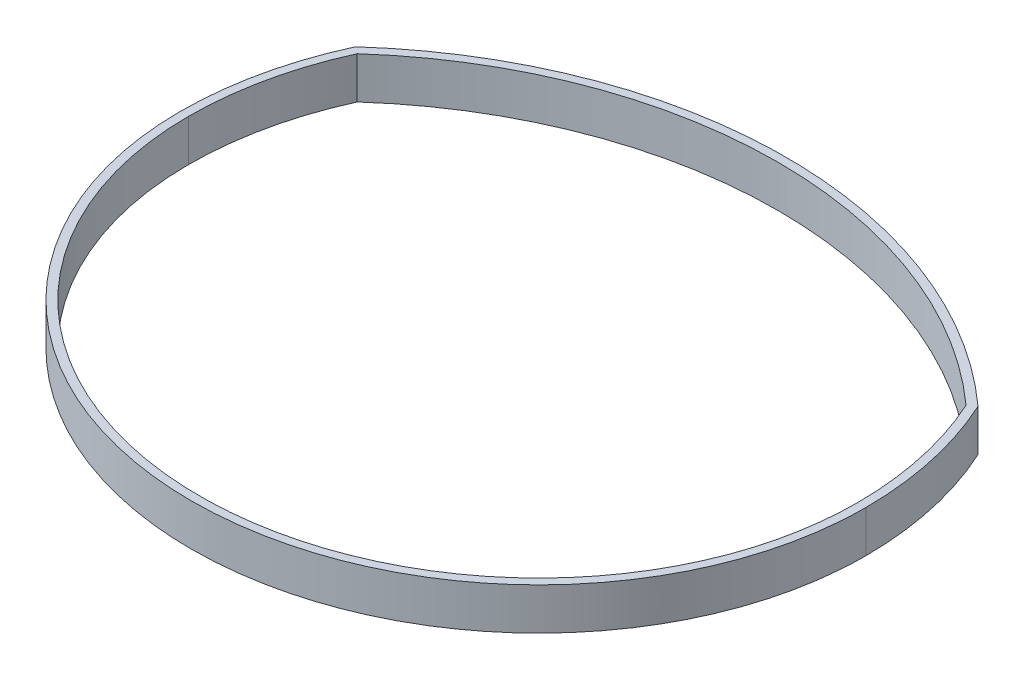
ISO-10303-21;
HEADER;
FILE_DESCRIPTION(('STEP AP214'),'2;1');
FILE_NAME('part.step','',(''),(''),'','','');
FILE_SCHEMA(('AUTOMOTIVE_DESIGN { 1 0 10303 214 1 1 1 1 }'));
ENDSEC;
DATA;
#1=APPLICATION_CONTEXT('core data for automotive mechanical design processes');
#2=APPLICATION_PROTOCOL_DEFINITION('international standard','automotive_design',2000,#1);
#3=PRODUCT_CONTEXT('',#1,'mechanical');
#4=PRODUCT('Part','Part','',(#3));
#5=PRODUCT_RELATED_PRODUCT_CATEGORY('part','',(#4));
#6=PRODUCT_DEFINITION_FORMATION('','',#4);
#7=PRODUCT_DEFINITION_CONTEXT('part definition',#1,'design');
#8=PRODUCT_DEFINITION('design','',#6,#7);
#9=PRODUCT_DEFINITION_SHAPE('','',#8);
#10=(LENGTH_UNIT() NAMED_UNIT(*) SI_UNIT(.MILLI.,.METRE.));
#11=(NAMED_UNIT(*) PLANE_ANGLE_UNIT() SI_UNIT($,.RADIAN.));
#12=(NAMED_UNIT(*) SI_UNIT($,.STERADIAN.) SOLID_ANGLE_UNIT());
#13=UNCERTAINTY_MEASURE_WITH_UNIT(LENGTH_MEASURE(1.E-05),#10,'distance_accuracy_value','');
#14=(GEOMETRIC_REPRESENTATION_CONTEXT(3) GLOBAL_UNCERTAINTY_ASSIGNED_CONTEXT((#13)) GLOBAL_UNIT_ASSIGNED_CONTEXT((#10,
#11,#12)) REPRESENTATION_CONTEXT('',''));
#15=CARTESIAN_POINT('',(0.,0.,0.));
#16=DIRECTION('',(0.,0.,1.));
#17=DIRECTION('',(1.,0.,0.));
#18=AXIS2_PLACEMENT_3D('',#15,#16,#17);
#19=CARTESIAN_POINT('',(0.,12.7,0.));
#20=DIRECTION('',(0.,-1.,0.));
#21=DIRECTION('',(0.,0.,-1.));
#22=AXIS2_PLACEMENT_3D('',#19,#20,#21);
#23=CYLINDRICAL_SURFACE('',#22,104.14);
#24=CARTESIAN_POINT('',(0.,0.,0.));
#25=DIRECTION('',(0.,1.,0.));
#26=DIRECTION('',(0.,0.,1.));
#27=AXIS2_PLACEMENT_3D('',#24,#25,#26);
#28=CIRCLE('',#27,104.14);
#29=CARTESIAN_POINT('',(-94.5401465283261,0.,-43.6726492716279));
#30=VERTEX_POINT('',#29);
#31=CARTESIAN_POINT('',(-104.14,0.,0.));
#32=VERTEX_POINT('',#31);
#33=EDGE_CURVE('E160',#30,#32,#28,.T.);
#34=ORIENTED_EDGE('',*,*,#33,.T.);
#35=DIRECTION('',(0.,-1.,0.));
#36=VECTOR('',#35,1.);
#37=CARTESIAN_POINT('',(-104.14,12.7,0.));
#38=LINE('',#37,#36);
#39=CARTESIAN_POINT('',(-104.14,12.7,0.));
#40=VERTEX_POINT('',#39);
#41=EDGE_CURVE('E11',#40,#32,#38,.T.);
#42=ORIENTED_EDGE('',*,*,#41,.F.);
#43=CARTESIAN_POINT('',(0.,12.7,0.));
#44=DIRECTION('',(0.,1.,0.));
#45=DIRECTION('',(0.,0.,1.));
#46=AXIS2_PLACEMENT_3D('',#43,#44,#45);
#47=CIRCLE('',#46,104.14);
#48=CARTESIAN_POINT('',(-94.5401465283261,12.7,-43.6726492716279));
#49=VERTEX_POINT('',#48);
#50=EDGE_CURVE('E123',#49,#40,#47,.T.);
#51=ORIENTED_EDGE('',*,*,#50,.F.);
#52=DIRECTION('',(0.,-1.,0.));
#53=VECTOR('',#52,1.);
#54=CARTESIAN_POINT('',(-94.5401465283261,12.7,-43.6726492716279));
#55=LINE('',#54,#53);
#56=EDGE_CURVE('E176',#49,#30,#55,.T.);
#57=ORIENTED_EDGE('',*,*,#56,.T.);
#58=EDGE_LOOP('',(#34,#42,#51,#57));
#59=FACE_BOUND('',#58,.T.);
#60=ADVANCED_FACE('F41',(#59),#23,.T.);
#61=CARTESIAN_POINT('',(-104.14,12.7,0.));
#62=CARTESIAN_POINT('',(-104.14,12.7,6.58621642734078));
#63=CARTESIAN_POINT('',(-102.793867123713,12.7,19.7873509878516));
#64=CARTESIAN_POINT('',(-94.8352631791728,12.7,45.1445437391471));
#65=CARTESIAN_POINT('',(-75.5215052836676,12.7,73.0746110420761));
#66=CARTESIAN_POINT('',(-40.8557906224662,12.7,95.438590327051));
#67=CARTESIAN_POINT('',(0.,12.7,103.286907831159));
#68=CARTESIAN_POINT('',(40.8557906224662,12.7,95.438590327051));
#69=CARTESIAN_POINT('',(75.5215052836676,12.7,73.0746110420761));
#70=CARTESIAN_POINT('',(94.8352631791728,12.7,45.1445437391471));
#71=CARTESIAN_POINT('',(102.793867123713,12.7,19.7873509878516));
#72=CARTESIAN_POINT('',(104.14,12.7,6.58621642734078));
#73=CARTESIAN_POINT('',(104.14,12.7,0.));
#74=B_SPLINE_CURVE_WITH_KNOTS('',3,(#61,#62,#63,#64,#65,#66,#67,#68,#69,#70,#71,#72,#73),
.UNSPECIFIED.,.F.,.F.,(4,1,1,1,1,1,1,1,1,1,4),(0.,0.196349540849362,0.392699081698724,
0.785398163397448,1.17809724509617,1.5707963267949,1.96349540849362,2.35619449019234,
2.74889357189107,2.94524311274043,3.14159265358979),.UNSPECIFIED.);
#75=DIRECTION('',(0.,-1.,0.));
#76=VECTOR('',#75,1.);
#77=SURFACE_OF_LINEAR_EXTRUSION('',#74,#76);
#78=CARTESIAN_POINT('',(-104.14,0.,0.));
#79=CARTESIAN_POINT('',(-104.14,0.,6.58621642734078));
#80=CARTESIAN_POINT('',(-102.793867123713,0.,19.7873509878516));
#81=CARTESIAN_POINT('',(-94.8352631791728,0.,45.1445437391471));
#82=CARTESIAN_POINT('',(-75.5215052836676,0.,73.0746110420761));
#83=CARTESIAN_POINT('',(-40.8557906224662,0.,95.438590327051));
#84=CARTESIAN_POINT('',(0.,0.,103.286907831159));
#85=CARTESIAN_POINT('',(40.8557906224662,0.,95.438590327051));
#86=CARTESIAN_POINT('',(75.5215052836676,0.,73.0746110420761));
#87=CARTESIAN_POINT('',(94.8352631791728,0.,45.1445437391471));
#88=CARTESIAN_POINT('',(102.793867123713,0.,19.7873509878516));
#89=CARTESIAN_POINT('',(104.14,0.,6.58621642734078));
#90=CARTESIAN_POINT('',(104.14,0.,0.));
#91=B_SPLINE_CURVE_WITH_KNOTS('',3,(#78,#79,#80,#81,#82,#83,#84,#85,#86,#87,#88,#89,#90),
.UNSPECIFIED.,.F.,.F.,(4,1,1,1,1,1,1,1,1,1,4),(0.,0.196349540849362,0.392699081698724,
0.785398163397448,1.17809724509617,1.5707963267949,1.96349540849362,2.35619449019234,
2.74889357189107,2.94524311274043,3.14159265358979),.UNSPECIFIED.);
#92=CARTESIAN_POINT('',(104.14,0.,0.));
#93=VERTEX_POINT('',#92);
#94=EDGE_CURVE('E129',#32,#93,#91,.T.);
#95=ORIENTED_EDGE('',*,*,#94,.T.);
#96=DIRECTION('',(0.,-1.,0.));
#97=VECTOR('',#96,1.);
#98=CARTESIAN_POINT('',(104.14,12.7,0.));
#99=LINE('',#98,#97);
#100=CARTESIAN_POINT('',(104.14,12.7,0.));
#101=VERTEX_POINT('',#100);
#102=EDGE_CURVE('E52',#101,#93,#99,.T.);
#103=ORIENTED_EDGE('',*,*,#102,.F.);
#104=EDGE_CURVE('E117',#40,#101,#74,.T.);
#105=ORIENTED_EDGE('',*,*,#104,.F.);
#106=ORIENTED_EDGE('',*,*,#41,.T.);
#107=EDGE_LOOP('',(#95,#103,#105,#106));
#108=FACE_BOUND('',#107,.T.);
#109=ADVANCED_FACE('F128',(#108),#77,.F.);
#110=CARTESIAN_POINT('',(0.,12.7,0.));
#111=DIRECTION('',(0.,-1.,0.));
#112=DIRECTION('',(0.,0.,-1.));
#113=AXIS2_PLACEMENT_3D('',#110,#111,#112);
#114=CYLINDRICAL_SURFACE('',#113,104.14);
#115=CARTESIAN_POINT('',(0.,0.,0.));
#116=DIRECTION('',(0.,1.,0.));
#117=DIRECTION('',(0.,0.,1.));
#118=AXIS2_PLACEMENT_3D('',#115,#116,#117);
#119=CIRCLE('',#118,104.14);
#120=CARTESIAN_POINT('',(94.5401465283261,0.,-43.672649271628));
#121=VERTEX_POINT('',#120);
#122=EDGE_CURVE('E90',#93,#121,#119,.T.);
#123=ORIENTED_EDGE('',*,*,#122,.T.);
#124=DIRECTION('',(0.,-1.,0.));
#125=VECTOR('',#124,1.);
#126=CARTESIAN_POINT('',(94.5401465283261,12.7,-43.672649271628));
#127=LINE('',#126,#125);
#128=CARTESIAN_POINT('',(94.5401465283261,12.7,-43.672649271628));
#129=VERTEX_POINT('',#128);
#130=EDGE_CURVE('E131',#129,#121,#127,.T.);
#131=ORIENTED_EDGE('',*,*,#130,.F.);
#132=CARTESIAN_POINT('',(0.,12.7,0.));
#133=DIRECTION('',(0.,1.,0.));
#134=DIRECTION('',(0.,0.,1.));
#135=AXIS2_PLACEMENT_3D('',#132,#133,#134);
#136=CIRCLE('',#135,104.14);
#137=EDGE_CURVE('E121',#101,#129,#136,.T.);
#138=ORIENTED_EDGE('',*,*,#137,.F.);
#139=ORIENTED_EDGE('',*,*,#102,.T.);
#140=EDGE_LOOP('',(#123,#131,#138,#139));
#141=FACE_BOUND('',#140,.T.);
#142=ADVANCED_FACE('F133',(#141),#114,.T.);
#143=CARTESIAN_POINT('',(0.,12.7,0.));
#144=DIRECTION('',(0.,-1.,0.));
#145=DIRECTION('',(0.,0.,-1.));
#146=AXIS2_PLACEMENT_3D('',#143,#144,#145);
#147=CYLINDRICAL_SURFACE('',#146,101.6);
#148=CARTESIAN_POINT('',(0.,0.,0.));
#149=DIRECTION('',(0.,1.,0.));
#150=DIRECTION('',(0.,0.,1.));
#151=AXIS2_PLACEMENT_3D('',#148,#149,#150);
#152=CIRCLE('',#151,101.6);
#153=CARTESIAN_POINT('',(-92.4508074401865,0.,-42.1355930735234));
#154=VERTEX_POINT('',#153);
#155=CARTESIAN_POINT('',(-101.6,0.,0.));
#156=VERTEX_POINT('',#155);
#157=EDGE_CURVE('E144',#154,#156,#152,.T.);
#158=ORIENTED_EDGE('',*,*,#157,.F.);
#159=DIRECTION('',(0.,-1.,0.));
#160=VECTOR('',#159,1.);
#161=CARTESIAN_POINT('',(-92.4508074401865,12.7,-42.1355930735234));
#162=LINE('',#161,#160);
#163=CARTESIAN_POINT('',(-92.4508074401865,12.7,-42.1355930735234));
#164=VERTEX_POINT('',#163);
#165=EDGE_CURVE('E45',#164,#154,#162,.T.);
#166=ORIENTED_EDGE('',*,*,#165,.F.);
#167=CARTESIAN_POINT('',(0.,12.7,0.));
#168=DIRECTION('',(0.,1.,0.));
#169=DIRECTION('',(0.,0.,1.));
#170=AXIS2_PLACEMENT_3D('',#167,#168,#169);
#171=CIRCLE('',#170,101.6);
#172=CARTESIAN_POINT('',(-101.6,12.7,0.));
#173=VERTEX_POINT('',#172);
#174=EDGE_CURVE('E175',#164,#173,#171,.T.);
#175=ORIENTED_EDGE('',*,*,#174,.T.);
#176=DIRECTION('',(0.,-1.,0.));
#177=VECTOR('',#176,1.);
#178=CARTESIAN_POINT('',(-101.6,12.7,0.));
#179=LINE('',#178,#177);
#180=EDGE_CURVE('E137',#173,#156,#179,.T.);
#181=ORIENTED_EDGE('',*,*,#180,.T.);
#182=EDGE_LOOP('',(#158,#166,#175,#181));
#183=FACE_BOUND('',#182,.T.);
#184=ADVANCED_FACE('F43',(#183),#147,.F.);
#185=CARTESIAN_POINT('',(0.,12.7,61.0492054603025));
#186=DIRECTION('',(0.,-1.,0.));
#187=DIRECTION('',(0.,0.,-1.));
#188=AXIS2_PLACEMENT_3D('',#185,#186,#187);
#189=CYLINDRICAL_SURFACE('',#188,138.543330567764);
#190=CARTESIAN_POINT('',(0.,0.,61.0492054603025));
#191=DIRECTION('',(0.,1.,0.));
#192=DIRECTION('',(0.,0.,1.));
#193=AXIS2_PLACEMENT_3D('',#190,#191,#192);
#194=CIRCLE('',#193,138.543330567764);
#195=CARTESIAN_POINT('',(92.4508074401865,0.,-42.1355930735234));
#196=VERTEX_POINT('',#195);
#197=EDGE_CURVE('E148',#196,#154,#194,.T.);
#198=ORIENTED_EDGE('',*,*,#197,.F.);
#199=DIRECTION('',(0.,-1.,0.));
#200=VECTOR('',#199,1.);
#201=CARTESIAN_POINT('',(92.4508074401865,12.7,-42.1355930735234));
#202=LINE('',#201,#200);
#203=CARTESIAN_POINT('',(92.4508074401865,12.7,-42.1355930735234));
#204=VERTEX_POINT('',#203);
#205=EDGE_CURVE('E185',#204,#196,#202,.T.);
#206=ORIENTED_EDGE('',*,*,#205,.F.);
#207=CARTESIAN_POINT('',(0.,12.7,61.0492054603025));
#208=DIRECTION('',(0.,1.,0.));
#209=DIRECTION('',(0.,0.,1.));
#210=AXIS2_PLACEMENT_3D('',#207,#208,#209);
#211=CIRCLE('',#210,138.543330567764);
#212=EDGE_CURVE('E196',#204,#164,#211,.T.);
#213=ORIENTED_EDGE('',*,*,#212,.T.);
#214=ORIENTED_EDGE('',*,*,#165,.T.);
#215=EDGE_LOOP('',(#198,#206,#213,#214));
#216=FACE_BOUND('',#215,.T.);
#217=ADVANCED_FACE('F194',(#216),#189,.F.);
#218=CARTESIAN_POINT('',(0.,12.7,0.));
#219=DIRECTION('',(0.,-1.,0.));
#220=DIRECTION('',(0.,0.,-1.));
#221=AXIS2_PLACEMENT_3D('',#218,#219,#220);
#222=CYLINDRICAL_SURFACE('',#221,101.6);
#223=CARTESIAN_POINT('',(0.,0.,0.));
#224=DIRECTION('',(0.,1.,0.));
#225=DIRECTION('',(0.,0.,1.));
#226=AXIS2_PLACEMENT_3D('',#223,#224,#225);
#227=CIRCLE('',#226,101.6);
#228=CARTESIAN_POINT('',(101.6,0.,0.));
#229=VERTEX_POINT('',#228);
#230=EDGE_CURVE('E152',#229,#196,#227,.T.);
#231=ORIENTED_EDGE('',*,*,#230,.F.);
#232=DIRECTION('',(0.,-1.,0.));
#233=VECTOR('',#232,1.);
#234=CARTESIAN_POINT('',(101.6,12.7,0.));
#235=LINE('',#234,#233);
#236=CARTESIAN_POINT('',(101.6,12.7,0.));
#237=VERTEX_POINT('',#236);
#238=EDGE_CURVE('E183',#237,#229,#235,.T.);
#239=ORIENTED_EDGE('',*,*,#238,.F.);
#240=CARTESIAN_POINT('',(0.,12.7,0.));
#241=DIRECTION('',(0.,1.,0.));
#242=DIRECTION('',(0.,0.,1.));
#243=AXIS2_PLACEMENT_3D('',#240,#241,#242);
#244=CIRCLE('',#243,101.6);
#245=EDGE_CURVE('E203',#237,#204,#244,.T.);
#246=ORIENTED_EDGE('',*,*,#245,.T.);
#247=ORIENTED_EDGE('',*,*,#205,.T.);
#248=EDGE_LOOP('',(#231,#239,#246,#247));
#249=FACE_BOUND('',#248,.T.);
#250=ADVANCED_FACE('F201',(#249),#222,.F.);
#251=CARTESIAN_POINT('',(0.,12.7,0.));
#252=DIRECTION('',(0.,1.,0.));
#253=DIRECTION('',(-1.,0.,0.));
#254=AXIS2_PLACEMENT_3D('',#251,#252,#253);
#255=ELLIPSE('',#254,101.6,98.1308019964563);
#256=DIRECTION('',(0.,-1.,0.));
#257=VECTOR('',#256,1.);
#258=SURFACE_OF_LINEAR_EXTRUSION('',#255,#257);
#259=CARTESIAN_POINT('',(0.,0.,0.));
#260=DIRECTION('',(0.,1.,0.));
#261=DIRECTION('',(-1.,0.,0.));
#262=AXIS2_PLACEMENT_3D('',#259,#260,#261);
#263=ELLIPSE('',#262,101.6,98.1308019964563);
#264=EDGE_CURVE('E156',#156,#229,#263,.T.);
#265=ORIENTED_EDGE('',*,*,#264,.F.);
#266=ORIENTED_EDGE('',*,*,#180,.F.);
#267=EDGE_CURVE('E208',#173,#237,#255,.T.);
#268=ORIENTED_EDGE('',*,*,#267,.T.);
#269=ORIENTED_EDGE('',*,*,#238,.T.);
#270=EDGE_LOOP('',(#265,#266,#268,#269));
#271=FACE_BOUND('',#270,.T.);
#272=ADVANCED_FACE('F211',(#271),#258,.T.);
#273=CARTESIAN_POINT('',(0.,12.7,61.0492054603025));
#274=DIRECTION('',(0.,-1.,0.));
#275=DIRECTION('',(0.,0.,-1.));
#276=AXIS2_PLACEMENT_3D('',#273,#274,#275);
#277=CYLINDRICAL_SURFACE('',#276,141.083330567764);
#278=CARTESIAN_POINT('',(0.,0.,61.0492054603025));
#279=DIRECTION('',(0.,1.,0.));
#280=DIRECTION('',(0.,0.,1.));
#281=AXIS2_PLACEMENT_3D('',#278,#279,#280);
#282=CIRCLE('',#281,141.083330567764);
#283=EDGE_CURVE('E96',#121,#30,#282,.T.);
#284=ORIENTED_EDGE('',*,*,#283,.T.);
#285=ORIENTED_EDGE('',*,*,#56,.F.);
#286=CARTESIAN_POINT('',(0.,12.7,61.0492054603025));
#287=DIRECTION('',(0.,1.,0.));
#288=DIRECTION('',(0.,0.,1.));
#289=AXIS2_PLACEMENT_3D('',#286,#287,#288);
#290=CIRCLE('',#289,141.083330567764);
#291=EDGE_CURVE('E61',#129,#49,#290,.T.);
#292=ORIENTED_EDGE('',*,*,#291,.F.);
#293=ORIENTED_EDGE('',*,*,#130,.T.);
#294=EDGE_LOOP('',(#284,#285,#292,#293));
#295=FACE_BOUND('',#294,.T.);
#296=ADVANCED_FACE('F221',(#295),#277,.T.);
#297=CARTESIAN_POINT('',(0.,12.7,0.));
#298=DIRECTION('',(0.,1.,0.));
#299=DIRECTION('',(0.,0.,1.));
#300=AXIS2_PLACEMENT_3D('',#297,#298,#299);
#301=PLANE('',#300);
#302=ORIENTED_EDGE('',*,*,#174,.F.);
#303=ORIENTED_EDGE('',*,*,#212,.F.);
#304=ORIENTED_EDGE('',*,*,#245,.F.);
#305=ORIENTED_EDGE('',*,*,#267,.F.);
#306=EDGE_LOOP('',(#302,#303,#304,#305));
#307=FACE_BOUND('',#306,.T.);
#308=ORIENTED_EDGE('',*,*,#50,.T.);
#309=ORIENTED_EDGE('',*,*,#104,.T.);
#310=ORIENTED_EDGE('',*,*,#137,.T.);
#311=ORIENTED_EDGE('',*,*,#291,.T.);
#312=EDGE_LOOP('',(#308,#309,#310,#311));
#313=FACE_BOUND('',#312,.T.);
#314=ADVANCED_FACE('F119',(#307,#313),#301,.T.);
#315=CARTESIAN_POINT('',(0.,0.,0.));
#316=DIRECTION('',(0.,1.,0.));
#317=DIRECTION('',(0.,0.,1.));
#318=AXIS2_PLACEMENT_3D('',#315,#316,#317);
#319=PLANE('',#318);
#320=ORIENTED_EDGE('',*,*,#157,.T.);
#321=ORIENTED_EDGE('',*,*,#264,.T.);
#322=ORIENTED_EDGE('',*,*,#230,.T.);
#323=ORIENTED_EDGE('',*,*,#197,.T.);
#324=EDGE_LOOP('',(#320,#321,#322,#323));
#325=FACE_BOUND('',#324,.T.);
#326=ORIENTED_EDGE('',*,*,#33,.F.);
#327=ORIENTED_EDGE('',*,*,#283,.F.);
#328=ORIENTED_EDGE('',*,*,#122,.F.);
#329=ORIENTED_EDGE('',*,*,#94,.F.);
#330=EDGE_LOOP('',(#326,#327,#328,#329));
#331=FACE_BOUND('',#330,.T.);
#332=ADVANCED_FACE('F199',(#325,#331),#319,.F.);
#333=CLOSED_SHELL('',(#60,#109,#142,#184,#217,#250,#272,#296,#314,#332));
#334=MANIFOLD_SOLID_BREP('B2',#333);
#335=ADVANCED_BREP_SHAPE_REPRESENTATION('',(#18,#334),#14);
#336=SHAPE_DEFINITION_REPRESENTATION(#9,#335);
ENDSEC;
END-ISO-10303-21;
